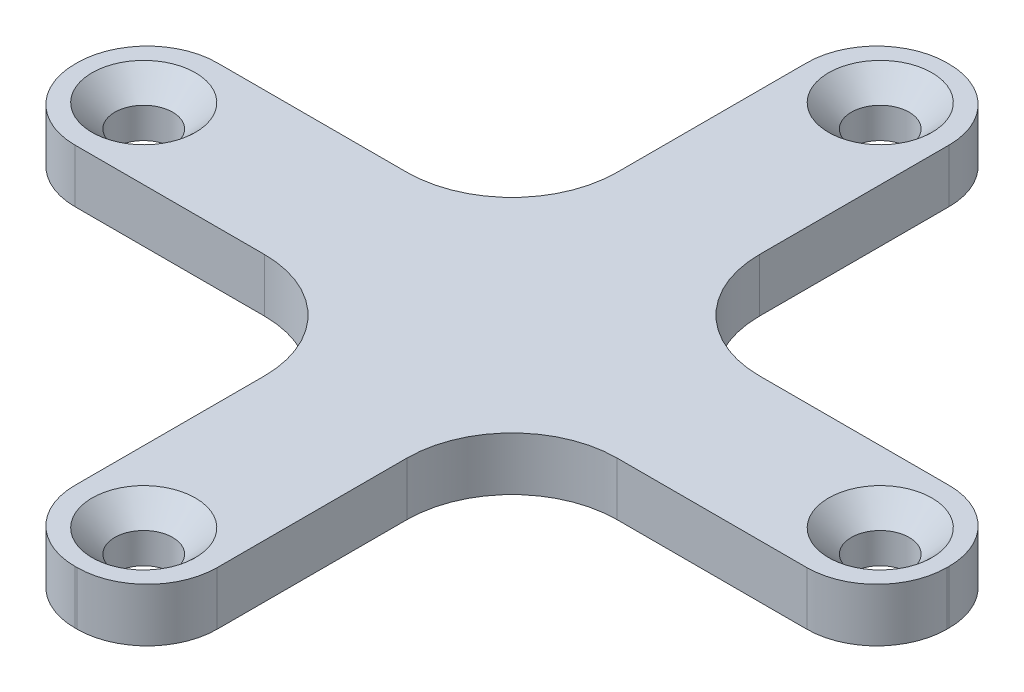
ISO-10303-21;
HEADER;
FILE_DESCRIPTION(('STEP AP214'),'2;1');
FILE_NAME('part.step','',(''),(''),'','','');
FILE_SCHEMA(('AUTOMOTIVE_DESIGN { 1 0 10303 214 1 1 1 1 }'));
ENDSEC;
DATA;
#1=APPLICATION_CONTEXT('core data for automotive mechanical design processes');
#2=APPLICATION_PROTOCOL_DEFINITION('international standard','automotive_design',2000,#1);
#3=PRODUCT_CONTEXT('',#1,'mechanical');
#4=PRODUCT('Part','Part','',(#3));
#5=PRODUCT_RELATED_PRODUCT_CATEGORY('part','',(#4));
#6=PRODUCT_DEFINITION_FORMATION('','',#4);
#7=PRODUCT_DEFINITION_CONTEXT('part definition',#1,'design');
#8=PRODUCT_DEFINITION('design','',#6,#7);
#9=PRODUCT_DEFINITION_SHAPE('','',#8);
#10=(LENGTH_UNIT() NAMED_UNIT(*) SI_UNIT(.MILLI.,.METRE.));
#11=(NAMED_UNIT(*) PLANE_ANGLE_UNIT() SI_UNIT($,.RADIAN.));
#12=(NAMED_UNIT(*) SI_UNIT($,.STERADIAN.) SOLID_ANGLE_UNIT());
#13=UNCERTAINTY_MEASURE_WITH_UNIT(LENGTH_MEASURE(1.E-05),#10,'distance_accuracy_value','');
#14=(GEOMETRIC_REPRESENTATION_CONTEXT(3) GLOBAL_UNCERTAINTY_ASSIGNED_CONTEXT((#13)) GLOBAL_UNIT_ASSIGNED_CONTEXT((#10,
#11,#12)) REPRESENTATION_CONTEXT('',''));
#15=CARTESIAN_POINT('',(0.,0.,0.));
#16=DIRECTION('',(0.,0.,1.));
#17=DIRECTION('',(1.,0.,0.));
#18=AXIS2_PLACEMENT_3D('',#15,#16,#17);
#19=CARTESIAN_POINT('',(24.895,3.048,4.06399999999997));
#20=DIRECTION('',(0.,-1.,0.));
#21=DIRECTION('',(0.,0.,-1.));
#22=AXIS2_PLACEMENT_3D('',#19,#20,#21);
#23=PLANE('',#22);
#24=CARTESIAN_POINT('',(0.,3.048,21.025));
#25=DIRECTION('',(0.,-1.,0.));
#26=DIRECTION('',(0.,0.,-1.));
#27=AXIS2_PLACEMENT_3D('',#24,#25,#26);
#28=CIRCLE('',#27,2.95100000000004);
#29=CARTESIAN_POINT('',(0.,3.048,18.074));
#30=VERTEX_POINT('',#29);
#31=EDGE_CURVE('E328',#30,#30,#28,.T.);
#32=ORIENTED_EDGE('',*,*,#31,.T.);
#33=EDGE_LOOP('',(#32));
#34=FACE_BOUND('',#33,.T.);
#35=CARTESIAN_POINT('',(-21.025,3.048,0.));
#36=DIRECTION('',(0.,-1.,0.));
#37=DIRECTION('',(0.,0.,-1.));
#38=AXIS2_PLACEMENT_3D('',#35,#36,#37);
#39=CIRCLE('',#38,2.95100000000004);
#40=CARTESIAN_POINT('',(-21.025,3.048,-2.95100000000003));
#41=VERTEX_POINT('',#40);
#42=EDGE_CURVE('E325',#41,#41,#39,.T.);
#43=ORIENTED_EDGE('',*,*,#42,.T.);
#44=EDGE_LOOP('',(#43));
#45=FACE_BOUND('',#44,.T.);
#46=CARTESIAN_POINT('',(0.,3.048,-21.025));
#47=DIRECTION('',(0.,-1.,0.));
#48=DIRECTION('',(0.,0.,-1.));
#49=AXIS2_PLACEMENT_3D('',#46,#47,#48);
#50=CIRCLE('',#49,2.95100000000004);
#51=CARTESIAN_POINT('',(0.,3.048,-23.976));
#52=VERTEX_POINT('',#51);
#53=EDGE_CURVE('E322',#52,#52,#50,.T.);
#54=ORIENTED_EDGE('',*,*,#53,.T.);
#55=EDGE_LOOP('',(#54));
#56=FACE_BOUND('',#55,.T.);
#57=CARTESIAN_POINT('',(21.025,3.048,0.));
#58=DIRECTION('',(0.,-1.,0.));
#59=DIRECTION('',(0.,0.,-1.));
#60=AXIS2_PLACEMENT_3D('',#57,#58,#59);
#61=CIRCLE('',#60,2.95100000000004);
#62=CARTESIAN_POINT('',(21.025,3.048,-2.95100000000004));
#63=VERTEX_POINT('',#62);
#64=EDGE_CURVE('E319',#63,#63,#61,.T.);
#65=ORIENTED_EDGE('',*,*,#64,.T.);
#66=EDGE_LOOP('',(#65));
#67=FACE_BOUND('',#66,.T.);
#68=DIRECTION('',(-1.,0.,0.));
#69=VECTOR('',#68,1.);
#70=CARTESIAN_POINT('',(4.06399999999998,3.048,-24.895));
#71=LINE('',#70,#69);
#72=CARTESIAN_POINT('',(0.0639999999999885,3.048,-24.895));
#73=VERTEX_POINT('',#72);
#74=CARTESIAN_POINT('',(-0.0640000000000059,3.048,-24.895));
#75=VERTEX_POINT('',#74);
#76=EDGE_CURVE('E450',#73,#75,#71,.T.);
#77=ORIENTED_EDGE('',*,*,#76,.T.);
#78=CARTESIAN_POINT('',(-0.0640000000000057,3.048,-20.895));
#79=DIRECTION('',(0.,-1.,0.));
#80=DIRECTION('',(0.,0.,-1.));
#81=AXIS2_PLACEMENT_3D('',#78,#79,#80);
#82=CIRCLE('',#81,4.);
#83=CARTESIAN_POINT('',(-4.06400000000001,3.048,-20.895));
#84=VERTEX_POINT('',#83);
#85=EDGE_CURVE('E278',#75,#84,#82,.F.);
#86=ORIENTED_EDGE('',*,*,#85,.T.);
#87=DIRECTION('',(0.,0.,1.));
#88=VECTOR('',#87,1.);
#89=CARTESIAN_POINT('',(-4.06400000000009,3.048,-4.064));
#90=LINE('',#89,#88);
#91=CARTESIAN_POINT('',(-4.06400000000006,3.048,-10.064));
#92=VERTEX_POINT('',#91);
#93=EDGE_CURVE('E214',#84,#92,#90,.T.);
#94=ORIENTED_EDGE('',*,*,#93,.T.);
#95=CARTESIAN_POINT('',(-10.0640000000001,3.048,-10.064));
#96=DIRECTION('',(0.,-1.,0.));
#97=DIRECTION('',(0.,0.,-1.));
#98=AXIS2_PLACEMENT_3D('',#95,#96,#97);
#99=CIRCLE('',#98,6.);
#100=CARTESIAN_POINT('',(-10.0640000000001,3.048,-4.06399999999999));
#101=VERTEX_POINT('',#100);
#102=EDGE_CURVE('E360',#92,#101,#99,.T.);
#103=ORIENTED_EDGE('',*,*,#102,.T.);
#104=DIRECTION('',(-1.,0.,0.));
#105=VECTOR('',#104,1.);
#106=CARTESIAN_POINT('',(-24.895,3.048,-4.06399999999998));
#107=LINE('',#106,#105);
#108=CARTESIAN_POINT('',(-20.895,3.048,-4.06399999999999));
#109=VERTEX_POINT('',#108);
#110=EDGE_CURVE('E428',#101,#109,#107,.T.);
#111=ORIENTED_EDGE('',*,*,#110,.T.);
#112=CARTESIAN_POINT('',(-20.895,3.048,-0.0639999999999885));
#113=DIRECTION('',(0.,-1.,0.));
#114=DIRECTION('',(0.,0.,-1.));
#115=AXIS2_PLACEMENT_3D('',#112,#113,#114);
#116=CIRCLE('',#115,4.);
#117=CARTESIAN_POINT('',(-24.895,3.048,-0.063999999999992));
#118=VERTEX_POINT('',#117);
#119=EDGE_CURVE('E264',#109,#118,#116,.F.);
#120=ORIENTED_EDGE('',*,*,#119,.T.);
#121=DIRECTION('',(0.,0.,1.));
#122=VECTOR('',#121,1.);
#123=CARTESIAN_POINT('',(-24.895,3.048,-4.06399999999998));
#124=LINE('',#123,#122);
#125=CARTESIAN_POINT('',(-24.895,3.048,0.0640000000000016));
#126=VERTEX_POINT('',#125);
#127=EDGE_CURVE('E425',#118,#126,#124,.T.);
#128=ORIENTED_EDGE('',*,*,#127,.T.);
#129=CARTESIAN_POINT('',(-20.895,3.048,0.0640000000000047));
#130=DIRECTION('',(0.,-1.,0.));
#131=DIRECTION('',(0.,0.,-1.));
#132=AXIS2_PLACEMENT_3D('',#129,#130,#131);
#133=CIRCLE('',#132,4.);
#134=CARTESIAN_POINT('',(-20.895,3.048,4.064));
#135=VERTEX_POINT('',#134);
#136=EDGE_CURVE('E266',#126,#135,#133,.F.);
#137=ORIENTED_EDGE('',*,*,#136,.T.);
#138=DIRECTION('',(1.,0.,0.));
#139=VECTOR('',#138,1.);
#140=CARTESIAN_POINT('',(-24.895,3.048,4.06400000000001));
#141=LINE('',#140,#139);
#142=CARTESIAN_POINT('',(-10.0640000000001,3.048,4.064));
#143=VERTEX_POINT('',#142);
#144=EDGE_CURVE('E421',#135,#143,#141,.T.);
#145=ORIENTED_EDGE('',*,*,#144,.T.);
#146=CARTESIAN_POINT('',(-10.0640000000001,3.048,10.064));
#147=DIRECTION('',(0.,-1.,0.));
#148=DIRECTION('',(0.,0.,-1.));
#149=AXIS2_PLACEMENT_3D('',#146,#147,#148);
#150=CIRCLE('',#149,6.);
#151=CARTESIAN_POINT('',(-4.06400000000007,3.048,10.064));
#152=VERTEX_POINT('',#151);
#153=EDGE_CURVE('E364',#143,#152,#150,.T.);
#154=ORIENTED_EDGE('',*,*,#153,.T.);
#155=DIRECTION('',(0.,0.,1.));
#156=VECTOR('',#155,1.);
#157=CARTESIAN_POINT('',(-4.064,3.048,24.895));
#158=LINE('',#157,#156);
#159=CARTESIAN_POINT('',(-4.06400000000002,3.048,20.895));
#160=VERTEX_POINT('',#159);
#161=EDGE_CURVE('E412',#152,#160,#158,.T.);
#162=ORIENTED_EDGE('',*,*,#161,.T.);
#163=CARTESIAN_POINT('',(-0.0640000000000189,3.048,20.895));
#164=DIRECTION('',(0.,-1.,0.));
#165=DIRECTION('',(0.,0.,-1.));
#166=AXIS2_PLACEMENT_3D('',#163,#164,#165);
#167=CIRCLE('',#166,4.);
#168=CARTESIAN_POINT('',(-0.0640000000000189,3.048,24.895));
#169=VERTEX_POINT('',#168);
#170=EDGE_CURVE('E268',#160,#169,#167,.F.);
#171=ORIENTED_EDGE('',*,*,#170,.T.);
#172=DIRECTION('',(1.,0.,0.));
#173=VECTOR('',#172,1.);
#174=CARTESIAN_POINT('',(4.064,3.048,24.895));
#175=LINE('',#174,#173);
#176=CARTESIAN_POINT('',(0.0639999999999842,3.048,24.895));
#177=VERTEX_POINT('',#176);
#178=EDGE_CURVE('E401',#169,#177,#175,.T.);
#179=ORIENTED_EDGE('',*,*,#178,.T.);
#180=CARTESIAN_POINT('',(0.0639999999999844,3.048,20.895));
#181=DIRECTION('',(0.,-1.,0.));
#182=DIRECTION('',(0.,0.,-1.));
#183=AXIS2_PLACEMENT_3D('',#180,#181,#182);
#184=CIRCLE('',#183,4.);
#185=CARTESIAN_POINT('',(4.06399999999998,3.048,20.895));
#186=VERTEX_POINT('',#185);
#187=EDGE_CURVE('E270',#177,#186,#184,.F.);
#188=ORIENTED_EDGE('',*,*,#187,.T.);
#189=DIRECTION('',(0.,0.,-1.));
#190=VECTOR('',#189,1.);
#191=CARTESIAN_POINT('',(4.06399999999991,3.048,4.064));
#192=LINE('',#191,#190);
#193=CARTESIAN_POINT('',(4.06399999999994,3.048,10.064));
#194=VERTEX_POINT('',#193);
#195=EDGE_CURVE('E216',#186,#194,#192,.T.);
#196=ORIENTED_EDGE('',*,*,#195,.T.);
#197=CARTESIAN_POINT('',(10.0639999999999,3.048,10.064));
#198=DIRECTION('',(0.,-1.,0.));
#199=DIRECTION('',(0.,0.,-1.));
#200=AXIS2_PLACEMENT_3D('',#197,#198,#199);
#201=CIRCLE('',#200,6.);
#202=CARTESIAN_POINT('',(10.0639999999999,3.048,4.06399999999999));
#203=VERTEX_POINT('',#202);
#204=EDGE_CURVE('E368',#194,#203,#201,.T.);
#205=ORIENTED_EDGE('',*,*,#204,.T.);
#206=DIRECTION('',(1.,0.,0.));
#207=VECTOR('',#206,1.);
#208=CARTESIAN_POINT('',(4.06399999999991,3.048,4.064));
#209=LINE('',#208,#207);
#210=CARTESIAN_POINT('',(20.895,3.048,4.06399999999998));
#211=VERTEX_POINT('',#210);
#212=EDGE_CURVE('E243',#203,#211,#209,.T.);
#213=ORIENTED_EDGE('',*,*,#212,.T.);
#214=CARTESIAN_POINT('',(20.895,3.048,0.0639999999999764));
#215=DIRECTION('',(0.,-1.,0.));
#216=DIRECTION('',(0.,0.,-1.));
#217=AXIS2_PLACEMENT_3D('',#214,#215,#216);
#218=CIRCLE('',#217,4.);
#219=CARTESIAN_POINT('',(24.895,3.048,0.0639999999999799));
#220=VERTEX_POINT('',#219);
#221=EDGE_CURVE('E272',#211,#220,#218,.F.);
#222=ORIENTED_EDGE('',*,*,#221,.T.);
#223=DIRECTION('',(0.,0.,-1.));
#224=VECTOR('',#223,1.);
#225=CARTESIAN_POINT('',(24.895,3.048,-4.06399999999999));
#226=LINE('',#225,#224);
#227=CARTESIAN_POINT('',(24.895,3.048,-0.0639999999999894));
#228=VERTEX_POINT('',#227);
#229=EDGE_CURVE('E383',#220,#228,#226,.T.);
#230=ORIENTED_EDGE('',*,*,#229,.T.);
#231=CARTESIAN_POINT('',(20.895,3.048,-0.063999999999993));
#232=DIRECTION('',(0.,-1.,0.));
#233=DIRECTION('',(0.,0.,-1.));
#234=AXIS2_PLACEMENT_3D('',#231,#232,#233);
#235=CIRCLE('',#234,4.);
#236=CARTESIAN_POINT('',(20.895,3.048,-4.06399999999999));
#237=VERTEX_POINT('',#236);
#238=EDGE_CURVE('E274',#228,#237,#235,.F.);
#239=ORIENTED_EDGE('',*,*,#238,.T.);
#240=DIRECTION('',(-1.,0.,0.));
#241=VECTOR('',#240,1.);
#242=CARTESIAN_POINT('',(4.064,3.048,-4.064));
#243=LINE('',#242,#241);
#244=CARTESIAN_POINT('',(10.064,3.048,-4.064));
#245=VERTEX_POINT('',#244);
#246=EDGE_CURVE('E456',#237,#245,#243,.T.);
#247=ORIENTED_EDGE('',*,*,#246,.T.);
#248=CARTESIAN_POINT('',(10.064,3.048,-10.064));
#249=DIRECTION('',(0.,-1.,0.));
#250=DIRECTION('',(0.,0.,-1.));
#251=AXIS2_PLACEMENT_3D('',#248,#249,#250);
#252=CIRCLE('',#251,6.);
#253=CARTESIAN_POINT('',(4.064,3.048,-10.064));
#254=VERTEX_POINT('',#253);
#255=EDGE_CURVE('E11',#245,#254,#252,.T.);
#256=ORIENTED_EDGE('',*,*,#255,.T.);
#257=DIRECTION('',(0.,0.,-1.));
#258=VECTOR('',#257,1.);
#259=CARTESIAN_POINT('',(4.064,3.048,-4.064));
#260=LINE('',#259,#258);
#261=CARTESIAN_POINT('',(4.06399999999999,3.048,-20.895));
#262=VERTEX_POINT('',#261);
#263=EDGE_CURVE('E451',#254,#262,#260,.T.);
#264=ORIENTED_EDGE('',*,*,#263,.T.);
#265=CARTESIAN_POINT('',(0.0639999999999885,3.048,-20.895));
#266=DIRECTION('',(0.,-1.,0.));
#267=DIRECTION('',(0.,0.,-1.));
#268=AXIS2_PLACEMENT_3D('',#265,#266,#267);
#269=CIRCLE('',#268,4.);
#270=EDGE_CURVE('E276',#262,#73,#269,.F.);
#271=ORIENTED_EDGE('',*,*,#270,.T.);
#272=EDGE_LOOP('',(#77,#86,#94,#103,#111,#120,#128,#137,#145,#154,#162,#171,#179,#188,#196,#205,
#213,#222,#230,#239,#247,#256,#264,#271));
#273=FACE_BOUND('',#272,.T.);
#274=ADVANCED_FACE('F34',(#34,#45,#56,#67,#273),#23,.F.);
#275=CARTESIAN_POINT('',(24.895,0.,4.06399999999997));
#276=DIRECTION('',(0.,-1.,0.));
#277=DIRECTION('',(0.,0.,-1.));
#278=AXIS2_PLACEMENT_3D('',#275,#276,#277);
#279=PLANE('',#278);
#280=CARTESIAN_POINT('',(-21.025,0.,0.));
#281=DIRECTION('',(0.,1.,0.));
#282=DIRECTION('',(0.,0.,-1.));
#283=AXIS2_PLACEMENT_3D('',#280,#281,#282);
#284=CIRCLE('',#283,1.651);
#285=CARTESIAN_POINT('',(-21.025,0.,-1.65099999999999));
#286=VERTEX_POINT('',#285);
#287=EDGE_CURVE('E743',#286,#286,#284,.T.);
#288=ORIENTED_EDGE('',*,*,#287,.T.);
#289=EDGE_LOOP('',(#288));
#290=FACE_BOUND('',#289,.T.);
#291=CARTESIAN_POINT('',(21.025,0.,0.));
#292=DIRECTION('',(0.,1.,0.));
#293=DIRECTION('',(0.,0.,1.));
#294=AXIS2_PLACEMENT_3D('',#291,#292,#293);
#295=CIRCLE('',#294,1.651);
#296=CARTESIAN_POINT('',(21.025,0.,1.651));
#297=VERTEX_POINT('',#296);
#298=EDGE_CURVE('E436',#297,#297,#295,.T.);
#299=ORIENTED_EDGE('',*,*,#298,.T.);
#300=EDGE_LOOP('',(#299));
#301=FACE_BOUND('',#300,.T.);
#302=DIRECTION('',(0.,0.,1.));
#303=VECTOR('',#302,1.);
#304=CARTESIAN_POINT('',(-4.06400000000009,0.,-4.064));
#305=LINE('',#304,#303);
#306=CARTESIAN_POINT('',(-4.06400000000001,0.,-20.895));
#307=VERTEX_POINT('',#306);
#308=CARTESIAN_POINT('',(-4.06400000000006,0.,-10.064));
#309=VERTEX_POINT('',#308);
#310=EDGE_CURVE('E211',#307,#309,#305,.T.);
#311=ORIENTED_EDGE('',*,*,#310,.F.);
#312=CARTESIAN_POINT('',(-0.0640000000000057,0.,-20.895));
#313=DIRECTION('',(0.,-1.,0.));
#314=DIRECTION('',(0.,0.,-1.));
#315=AXIS2_PLACEMENT_3D('',#312,#313,#314);
#316=CIRCLE('',#315,4.);
#317=CARTESIAN_POINT('',(-0.0640000000000059,0.,-24.895));
#318=VERTEX_POINT('',#317);
#319=EDGE_CURVE('E195',#307,#318,#316,.T.);
#320=ORIENTED_EDGE('',*,*,#319,.T.);
#321=DIRECTION('',(-1.,0.,0.));
#322=VECTOR('',#321,1.);
#323=CARTESIAN_POINT('',(4.06399999999998,0.,-24.895));
#324=LINE('',#323,#322);
#325=CARTESIAN_POINT('',(0.0639999999999885,0.,-24.895));
#326=VERTEX_POINT('',#325);
#327=EDGE_CURVE('E223',#326,#318,#324,.T.);
#328=ORIENTED_EDGE('',*,*,#327,.F.);
#329=CARTESIAN_POINT('',(0.0639999999999885,0.,-20.895));
#330=DIRECTION('',(0.,-1.,0.));
#331=DIRECTION('',(0.,0.,-1.));
#332=AXIS2_PLACEMENT_3D('',#329,#330,#331);
#333=CIRCLE('',#332,4.);
#334=CARTESIAN_POINT('',(4.06399999999999,0.,-20.895));
#335=VERTEX_POINT('',#334);
#336=EDGE_CURVE('E205',#326,#335,#333,.T.);
#337=ORIENTED_EDGE('',*,*,#336,.T.);
#338=DIRECTION('',(0.,0.,-1.));
#339=VECTOR('',#338,1.);
#340=CARTESIAN_POINT('',(4.064,0.,-4.064));
#341=LINE('',#340,#339);
#342=CARTESIAN_POINT('',(4.064,0.,-10.064));
#343=VERTEX_POINT('',#342);
#344=EDGE_CURVE('E227',#343,#335,#341,.T.);
#345=ORIENTED_EDGE('',*,*,#344,.F.);
#346=CARTESIAN_POINT('',(10.064,0.,-10.064));
#347=DIRECTION('',(0.,-1.,0.));
#348=DIRECTION('',(0.,0.,-1.));
#349=AXIS2_PLACEMENT_3D('',#346,#347,#348);
#350=CIRCLE('',#349,6.);
#351=CARTESIAN_POINT('',(10.064,0.,-4.064));
#352=VERTEX_POINT('',#351);
#353=EDGE_CURVE('E42',#343,#352,#350,.F.);
#354=ORIENTED_EDGE('',*,*,#353,.T.);
#355=DIRECTION('',(-1.,0.,0.));
#356=VECTOR('',#355,1.);
#357=CARTESIAN_POINT('',(4.064,0.,-4.064));
#358=LINE('',#357,#356);
#359=CARTESIAN_POINT('',(20.895,0.,-4.06399999999999));
#360=VERTEX_POINT('',#359);
#361=EDGE_CURVE('E439',#360,#352,#358,.T.);
#362=ORIENTED_EDGE('',*,*,#361,.F.);
#363=CARTESIAN_POINT('',(20.895,0.,-0.063999999999993));
#364=DIRECTION('',(0.,-1.,0.));
#365=DIRECTION('',(0.,0.,-1.));
#366=AXIS2_PLACEMENT_3D('',#363,#364,#365);
#367=CIRCLE('',#366,4.);
#368=CARTESIAN_POINT('',(24.895,0.,-0.0639999999999894));
#369=VERTEX_POINT('',#368);
#370=EDGE_CURVE('E257',#360,#369,#367,.T.);
#371=ORIENTED_EDGE('',*,*,#370,.T.);
#372=DIRECTION('',(0.,0.,-1.));
#373=VECTOR('',#372,1.);
#374=CARTESIAN_POINT('',(24.895,0.,-4.06399999999999));
#375=LINE('',#374,#373);
#376=CARTESIAN_POINT('',(24.895,0.,0.0639999999999799));
#377=VERTEX_POINT('',#376);
#378=EDGE_CURVE('E435',#377,#369,#375,.T.);
#379=ORIENTED_EDGE('',*,*,#378,.F.);
#380=CARTESIAN_POINT('',(20.895,0.,0.0639999999999764));
#381=DIRECTION('',(0.,-1.,0.));
#382=DIRECTION('',(0.,0.,-1.));
#383=AXIS2_PLACEMENT_3D('',#380,#381,#382);
#384=CIRCLE('',#383,4.);
#385=CARTESIAN_POINT('',(20.895,0.,4.06399999999998));
#386=VERTEX_POINT('',#385);
#387=EDGE_CURVE('E254',#377,#386,#384,.T.);
#388=ORIENTED_EDGE('',*,*,#387,.T.);
#389=DIRECTION('',(1.,0.,0.));
#390=VECTOR('',#389,1.);
#391=CARTESIAN_POINT('',(4.06399999999991,0.,4.064));
#392=LINE('',#391,#390);
#393=CARTESIAN_POINT('',(10.0639999999999,0.,4.06399999999999));
#394=VERTEX_POINT('',#393);
#395=EDGE_CURVE('E387',#394,#386,#392,.T.);
#396=ORIENTED_EDGE('',*,*,#395,.F.);
#397=CARTESIAN_POINT('',(10.0639999999999,0.,10.064));
#398=DIRECTION('',(0.,-1.,0.));
#399=DIRECTION('',(0.,0.,-1.));
#400=AXIS2_PLACEMENT_3D('',#397,#398,#399);
#401=CIRCLE('',#400,6.);
#402=CARTESIAN_POINT('',(4.06399999999994,0.,10.064));
#403=VERTEX_POINT('',#402);
#404=EDGE_CURVE('E366',#394,#403,#401,.F.);
#405=ORIENTED_EDGE('',*,*,#404,.T.);
#406=DIRECTION('',(0.,0.,-1.));
#407=VECTOR('',#406,1.);
#408=CARTESIAN_POINT('',(4.06399999999991,0.,4.064));
#409=LINE('',#408,#407);
#410=CARTESIAN_POINT('',(4.06399999999998,0.,20.895));
#411=VERTEX_POINT('',#410);
#412=EDGE_CURVE('E241',#411,#403,#409,.T.);
#413=ORIENTED_EDGE('',*,*,#412,.F.);
#414=CARTESIAN_POINT('',(0.0639999999999844,0.,20.895));
#415=DIRECTION('',(0.,-1.,0.));
#416=DIRECTION('',(0.,0.,-1.));
#417=AXIS2_PLACEMENT_3D('',#414,#415,#416);
#418=CIRCLE('',#417,4.);
#419=CARTESIAN_POINT('',(0.0639999999999842,0.,24.895));
#420=VERTEX_POINT('',#419);
#421=EDGE_CURVE('E252',#411,#420,#418,.T.);
#422=ORIENTED_EDGE('',*,*,#421,.T.);
#423=DIRECTION('',(1.,0.,0.));
#424=VECTOR('',#423,1.);
#425=CARTESIAN_POINT('',(4.064,0.,24.895));
#426=LINE('',#425,#424);
#427=CARTESIAN_POINT('',(-0.0640000000000189,0.,24.895));
#428=VERTEX_POINT('',#427);
#429=EDGE_CURVE('E238',#428,#420,#426,.T.);
#430=ORIENTED_EDGE('',*,*,#429,.F.);
#431=CARTESIAN_POINT('',(-0.0640000000000189,0.,20.895));
#432=DIRECTION('',(0.,-1.,0.));
#433=DIRECTION('',(0.,0.,-1.));
#434=AXIS2_PLACEMENT_3D('',#431,#432,#433);
#435=CIRCLE('',#434,4.);
#436=CARTESIAN_POINT('',(-4.06400000000002,0.,20.895));
#437=VERTEX_POINT('',#436);
#438=EDGE_CURVE('E249',#428,#437,#435,.T.);
#439=ORIENTED_EDGE('',*,*,#438,.T.);
#440=DIRECTION('',(0.,0.,1.));
#441=VECTOR('',#440,1.);
#442=CARTESIAN_POINT('',(-4.064,0.,24.895));
#443=LINE('',#442,#441);
#444=CARTESIAN_POINT('',(-4.06400000000007,0.,10.064));
#445=VERTEX_POINT('',#444);
#446=EDGE_CURVE('E236',#445,#437,#443,.T.);
#447=ORIENTED_EDGE('',*,*,#446,.F.);
#448=CARTESIAN_POINT('',(-10.0640000000001,0.,10.064));
#449=DIRECTION('',(0.,-1.,0.));
#450=DIRECTION('',(0.,0.,-1.));
#451=AXIS2_PLACEMENT_3D('',#448,#449,#450);
#452=CIRCLE('',#451,6.);
#453=CARTESIAN_POINT('',(-10.0640000000001,0.,4.064));
#454=VERTEX_POINT('',#453);
#455=EDGE_CURVE('E362',#445,#454,#452,.F.);
#456=ORIENTED_EDGE('',*,*,#455,.T.);
#457=DIRECTION('',(1.,0.,0.));
#458=VECTOR('',#457,1.);
#459=CARTESIAN_POINT('',(-24.895,0.,4.06400000000001));
#460=LINE('',#459,#458);
#461=CARTESIAN_POINT('',(-20.895,0.,4.064));
#462=VERTEX_POINT('',#461);
#463=EDGE_CURVE('E233',#462,#454,#460,.T.);
#464=ORIENTED_EDGE('',*,*,#463,.F.);
#465=CARTESIAN_POINT('',(-20.895,0.,0.0640000000000047));
#466=DIRECTION('',(0.,-1.,0.));
#467=DIRECTION('',(0.,0.,-1.));
#468=AXIS2_PLACEMENT_3D('',#465,#466,#467);
#469=CIRCLE('',#468,4.);
#470=CARTESIAN_POINT('',(-24.895,0.,0.0640000000000016));
#471=VERTEX_POINT('',#470);
#472=EDGE_CURVE('E247',#462,#471,#469,.T.);
#473=ORIENTED_EDGE('',*,*,#472,.T.);
#474=DIRECTION('',(0.,0.,1.));
#475=VECTOR('',#474,1.);
#476=CARTESIAN_POINT('',(-24.895,0.,-4.06399999999998));
#477=LINE('',#476,#475);
#478=CARTESIAN_POINT('',(-24.895,0.,-0.063999999999992));
#479=VERTEX_POINT('',#478);
#480=EDGE_CURVE('E225',#479,#471,#477,.T.);
#481=ORIENTED_EDGE('',*,*,#480,.F.);
#482=CARTESIAN_POINT('',(-20.895,0.,-0.0639999999999885));
#483=DIRECTION('',(0.,-1.,0.));
#484=DIRECTION('',(0.,0.,-1.));
#485=AXIS2_PLACEMENT_3D('',#482,#483,#484);
#486=CIRCLE('',#485,4.);
#487=CARTESIAN_POINT('',(-20.895,0.,-4.06399999999999));
#488=VERTEX_POINT('',#487);
#489=EDGE_CURVE('E215',#479,#488,#486,.T.);
#490=ORIENTED_EDGE('',*,*,#489,.T.);
#491=DIRECTION('',(-1.,0.,0.));
#492=VECTOR('',#491,1.);
#493=CARTESIAN_POINT('',(-24.895,0.,-4.06399999999998));
#494=LINE('',#493,#492);
#495=CARTESIAN_POINT('',(-10.0640000000001,0.,-4.06399999999999));
#496=VERTEX_POINT('',#495);
#497=EDGE_CURVE('E222',#496,#488,#494,.T.);
#498=ORIENTED_EDGE('',*,*,#497,.F.);
#499=CARTESIAN_POINT('',(-10.0640000000001,0.,-10.064));
#500=DIRECTION('',(0.,-1.,0.));
#501=DIRECTION('',(0.,0.,-1.));
#502=AXIS2_PLACEMENT_3D('',#499,#500,#501);
#503=CIRCLE('',#502,6.);
#504=EDGE_CURVE('E221',#496,#309,#503,.F.);
#505=ORIENTED_EDGE('',*,*,#504,.T.);
#506=EDGE_LOOP('',(#311,#320,#328,#337,#345,#354,#362,#371,#379,#388,#396,#405,#413,#422,#430,
#439,#447,#456,#464,#473,#481,#490,#498,#505));
#507=FACE_BOUND('',#506,.T.);
#508=CARTESIAN_POINT('',(0.,0.,-21.025));
#509=DIRECTION('',(0.,1.,0.));
#510=DIRECTION('',(0.,0.,-1.));
#511=AXIS2_PLACEMENT_3D('',#508,#509,#510);
#512=CIRCLE('',#511,1.651);
#513=CARTESIAN_POINT('',(0.,0.,-22.676));
#514=VERTEX_POINT('',#513);
#515=EDGE_CURVE('E740',#514,#514,#512,.T.);
#516=ORIENTED_EDGE('',*,*,#515,.T.);
#517=EDGE_LOOP('',(#516));
#518=FACE_BOUND('',#517,.T.);
#519=CARTESIAN_POINT('',(0.,0.,21.025));
#520=DIRECTION('',(0.,1.,0.));
#521=DIRECTION('',(0.,0.,1.));
#522=AXIS2_PLACEMENT_3D('',#519,#520,#521);
#523=CIRCLE('',#522,1.651);
#524=CARTESIAN_POINT('',(0.,0.,22.676));
#525=VERTEX_POINT('',#524);
#526=EDGE_CURVE('E746',#525,#525,#523,.T.);
#527=ORIENTED_EDGE('',*,*,#526,.T.);
#528=EDGE_LOOP('',(#527));
#529=FACE_BOUND('',#528,.T.);
#530=ADVANCED_FACE('F218',(#290,#301,#507,#518,#529),#279,.T.);
#531=CARTESIAN_POINT('',(4.06399999999991,3.048,4.064));
#532=DIRECTION('',(0.,0.,-1.));
#533=DIRECTION('',(-1.,0.,0.));
#534=AXIS2_PLACEMENT_3D('',#531,#532,#533);
#535=PLANE('',#534);
#536=ORIENTED_EDGE('',*,*,#212,.F.);
#537=DIRECTION('',(0.,-1.,0.));
#538=VECTOR('',#537,1.);
#539=CARTESIAN_POINT('',(10.0639999999999,0.,4.06399999999999));
#540=LINE('',#539,#538);
#541=EDGE_CURVE('E350',#203,#394,#540,.T.);
#542=ORIENTED_EDGE('',*,*,#541,.T.);
#543=ORIENTED_EDGE('',*,*,#395,.T.);
#544=DIRECTION('',(0.,-1.,0.));
#545=VECTOR('',#544,1.);
#546=CARTESIAN_POINT('',(20.895,3.048,4.06399999999998));
#547=LINE('',#546,#545);
#548=EDGE_CURVE('E291',#386,#211,#547,.F.);
#549=ORIENTED_EDGE('',*,*,#548,.T.);
#550=EDGE_LOOP('',(#536,#542,#543,#549));
#551=FACE_BOUND('',#550,.T.);
#552=ADVANCED_FACE('F379',(#551),#535,.F.);
#553=CARTESIAN_POINT('',(24.895,3.048,-4.06399999999999));
#554=DIRECTION('',(-1.,0.,0.));
#555=DIRECTION('',(0.,0.,1.));
#556=AXIS2_PLACEMENT_3D('',#553,#554,#555);
#557=PLANE('',#556);
#558=ORIENTED_EDGE('',*,*,#378,.T.);
#559=DIRECTION('',(0.,-1.,0.));
#560=VECTOR('',#559,1.);
#561=CARTESIAN_POINT('',(24.895,3.048,-0.0639999999999894));
#562=LINE('',#561,#560);
#563=EDGE_CURVE('E289',#369,#228,#562,.F.);
#564=ORIENTED_EDGE('',*,*,#563,.T.);
#565=ORIENTED_EDGE('',*,*,#229,.F.);
#566=DIRECTION('',(0.,-1.,0.));
#567=VECTOR('',#566,1.);
#568=CARTESIAN_POINT('',(24.895,3.048,0.0639999999999799));
#569=LINE('',#568,#567);
#570=EDGE_CURVE('E286',#220,#377,#569,.T.);
#571=ORIENTED_EDGE('',*,*,#570,.T.);
#572=EDGE_LOOP('',(#558,#564,#565,#571));
#573=FACE_BOUND('',#572,.T.);
#574=ADVANCED_FACE('F519',(#573),#557,.F.);
#575=CARTESIAN_POINT('',(4.064,3.048,-4.064));
#576=DIRECTION('',(0.,0.,1.));
#577=DIRECTION('',(1.,0.,0.));
#578=AXIS2_PLACEMENT_3D('',#575,#576,#577);
#579=PLANE('',#578);
#580=ORIENTED_EDGE('',*,*,#361,.T.);
#581=DIRECTION('',(0.,-1.,0.));
#582=VECTOR('',#581,1.);
#583=CARTESIAN_POINT('',(10.064,3.048,-4.064));
#584=LINE('',#583,#582);
#585=EDGE_CURVE('E55',#352,#245,#584,.F.);
#586=ORIENTED_EDGE('',*,*,#585,.T.);
#587=ORIENTED_EDGE('',*,*,#246,.F.);
#588=DIRECTION('',(0.,-1.,0.));
#589=VECTOR('',#588,1.);
#590=CARTESIAN_POINT('',(20.895,3.048,-4.06399999999999));
#591=LINE('',#590,#589);
#592=EDGE_CURVE('E283',#237,#360,#591,.T.);
#593=ORIENTED_EDGE('',*,*,#592,.T.);
#594=EDGE_LOOP('',(#580,#586,#587,#593));
#595=FACE_BOUND('',#594,.T.);
#596=ADVANCED_FACE('F516',(#595),#579,.F.);
#597=CARTESIAN_POINT('',(4.064,3.048,-4.064));
#598=DIRECTION('',(-1.,0.,0.));
#599=DIRECTION('',(0.,0.,1.));
#600=AXIS2_PLACEMENT_3D('',#597,#598,#599);
#601=PLANE('',#600);
#602=ORIENTED_EDGE('',*,*,#263,.F.);
#603=DIRECTION('',(0.,-1.,0.));
#604=VECTOR('',#603,1.);
#605=CARTESIAN_POINT('',(4.064,0.,-10.064));
#606=LINE('',#605,#604);
#607=EDGE_CURVE('E355',#254,#343,#606,.T.);
#608=ORIENTED_EDGE('',*,*,#607,.T.);
#609=ORIENTED_EDGE('',*,*,#344,.T.);
#610=DIRECTION('',(0.,-1.,0.));
#611=VECTOR('',#610,1.);
#612=CARTESIAN_POINT('',(4.06399999999999,3.048,-20.895));
#613=LINE('',#612,#611);
#614=EDGE_CURVE('E280',#335,#262,#613,.F.);
#615=ORIENTED_EDGE('',*,*,#614,.T.);
#616=EDGE_LOOP('',(#602,#608,#609,#615));
#617=FACE_BOUND('',#616,.T.);
#618=ADVANCED_FACE('F442',(#617),#601,.F.);
#619=CARTESIAN_POINT('',(4.06399999999998,3.048,-24.895));
#620=DIRECTION('',(0.,0.,1.));
#621=DIRECTION('',(1.,0.,0.));
#622=AXIS2_PLACEMENT_3D('',#619,#620,#621);
#623=PLANE('',#622);
#624=ORIENTED_EDGE('',*,*,#327,.T.);
#625=DIRECTION('',(0.,-1.,0.));
#626=VECTOR('',#625,1.);
#627=CARTESIAN_POINT('',(-0.0640000000000059,3.048,-24.895));
#628=LINE('',#627,#626);
#629=EDGE_CURVE('E200',#318,#75,#628,.F.);
#630=ORIENTED_EDGE('',*,*,#629,.T.);
#631=ORIENTED_EDGE('',*,*,#76,.F.);
#632=DIRECTION('',(0.,-1.,0.));
#633=VECTOR('',#632,1.);
#634=CARTESIAN_POINT('',(0.0639999999999885,3.048,-24.895));
#635=LINE('',#634,#633);
#636=EDGE_CURVE('E204',#73,#326,#635,.T.);
#637=ORIENTED_EDGE('',*,*,#636,.T.);
#638=EDGE_LOOP('',(#624,#630,#631,#637));
#639=FACE_BOUND('',#638,.T.);
#640=ADVANCED_FACE('F453',(#639),#623,.F.);
#641=CARTESIAN_POINT('',(-4.06400000000009,3.048,-4.064));
#642=DIRECTION('',(1.,0.,0.));
#643=DIRECTION('',(0.,0.,-1.));
#644=AXIS2_PLACEMENT_3D('',#641,#642,#643);
#645=PLANE('',#644);
#646=ORIENTED_EDGE('',*,*,#310,.T.);
#647=DIRECTION('',(0.,-1.,0.));
#648=VECTOR('',#647,1.);
#649=CARTESIAN_POINT('',(-4.06400000000006,3.048,-10.064));
#650=LINE('',#649,#648);
#651=EDGE_CURVE('E343',#309,#92,#650,.F.);
#652=ORIENTED_EDGE('',*,*,#651,.T.);
#653=ORIENTED_EDGE('',*,*,#93,.F.);
#654=DIRECTION('',(0.,-1.,0.));
#655=VECTOR('',#654,1.);
#656=CARTESIAN_POINT('',(-4.06400000000001,3.048,-20.895));
#657=LINE('',#656,#655);
#658=EDGE_CURVE('E199',#84,#307,#657,.T.);
#659=ORIENTED_EDGE('',*,*,#658,.T.);
#660=EDGE_LOOP('',(#646,#652,#653,#659));
#661=FACE_BOUND('',#660,.T.);
#662=ADVANCED_FACE('F210',(#661),#645,.F.);
#663=CARTESIAN_POINT('',(-24.895,3.048,-4.06399999999998));
#664=DIRECTION('',(0.,0.,1.));
#665=DIRECTION('',(1.,0.,0.));
#666=AXIS2_PLACEMENT_3D('',#663,#664,#665);
#667=PLANE('',#666);
#668=ORIENTED_EDGE('',*,*,#110,.F.);
#669=DIRECTION('',(0.,-1.,0.));
#670=VECTOR('',#669,1.);
#671=CARTESIAN_POINT('',(-10.0640000000001,0.,-4.06399999999999));
#672=LINE('',#671,#670);
#673=EDGE_CURVE('E340',#101,#496,#672,.T.);
#674=ORIENTED_EDGE('',*,*,#673,.T.);
#675=ORIENTED_EDGE('',*,*,#497,.T.);
#676=DIRECTION('',(0.,-1.,0.));
#677=VECTOR('',#676,1.);
#678=CARTESIAN_POINT('',(-20.895,3.048,-4.06399999999999));
#679=LINE('',#678,#677);
#680=EDGE_CURVE('E313',#488,#109,#679,.F.);
#681=ORIENTED_EDGE('',*,*,#680,.T.);
#682=EDGE_LOOP('',(#668,#674,#675,#681));
#683=FACE_BOUND('',#682,.T.);
#684=ADVANCED_FACE('F466',(#683),#667,.F.);
#685=CARTESIAN_POINT('',(-24.895,3.048,-4.06399999999998));
#686=DIRECTION('',(1.,0.,0.));
#687=DIRECTION('',(0.,0.,-1.));
#688=AXIS2_PLACEMENT_3D('',#685,#686,#687);
#689=PLANE('',#688);
#690=ORIENTED_EDGE('',*,*,#480,.T.);
#691=DIRECTION('',(0.,-1.,0.));
#692=VECTOR('',#691,1.);
#693=CARTESIAN_POINT('',(-24.895,3.048,0.0640000000000016));
#694=LINE('',#693,#692);
#695=EDGE_CURVE('E311',#471,#126,#694,.F.);
#696=ORIENTED_EDGE('',*,*,#695,.T.);
#697=ORIENTED_EDGE('',*,*,#127,.F.);
#698=DIRECTION('',(0.,-1.,0.));
#699=VECTOR('',#698,1.);
#700=CARTESIAN_POINT('',(-24.895,3.048,-0.063999999999992));
#701=LINE('',#700,#699);
#702=EDGE_CURVE('E308',#118,#479,#701,.T.);
#703=ORIENTED_EDGE('',*,*,#702,.T.);
#704=EDGE_LOOP('',(#690,#696,#697,#703));
#705=FACE_BOUND('',#704,.T.);
#706=ADVANCED_FACE('F472',(#705),#689,.F.);
#707=CARTESIAN_POINT('',(-24.895,3.048,4.06400000000001));
#708=DIRECTION('',(0.,0.,-1.));
#709=DIRECTION('',(-1.,0.,0.));
#710=AXIS2_PLACEMENT_3D('',#707,#708,#709);
#711=PLANE('',#710);
#712=ORIENTED_EDGE('',*,*,#463,.T.);
#713=DIRECTION('',(0.,-1.,0.));
#714=VECTOR('',#713,1.);
#715=CARTESIAN_POINT('',(-10.0640000000001,3.048,4.064));
#716=LINE('',#715,#714);
#717=EDGE_CURVE('E348',#454,#143,#716,.F.);
#718=ORIENTED_EDGE('',*,*,#717,.T.);
#719=ORIENTED_EDGE('',*,*,#144,.F.);
#720=DIRECTION('',(0.,-1.,0.));
#721=VECTOR('',#720,1.);
#722=CARTESIAN_POINT('',(-20.895,3.048,4.064));
#723=LINE('',#722,#721);
#724=EDGE_CURVE('E305',#135,#462,#723,.T.);
#725=ORIENTED_EDGE('',*,*,#724,.T.);
#726=EDGE_LOOP('',(#712,#718,#719,#725));
#727=FACE_BOUND('',#726,.T.);
#728=ADVANCED_FACE('F420',(#727),#711,.F.);
#729=CARTESIAN_POINT('',(-4.064,3.048,24.895));
#730=DIRECTION('',(1.,0.,0.));
#731=DIRECTION('',(0.,0.,-1.));
#732=AXIS2_PLACEMENT_3D('',#729,#730,#731);
#733=PLANE('',#732);
#734=ORIENTED_EDGE('',*,*,#161,.F.);
#735=DIRECTION('',(0.,-1.,0.));
#736=VECTOR('',#735,1.);
#737=CARTESIAN_POINT('',(-4.06400000000007,0.,10.064));
#738=LINE('',#737,#736);
#739=EDGE_CURVE('E345',#152,#445,#738,.T.);
#740=ORIENTED_EDGE('',*,*,#739,.T.);
#741=ORIENTED_EDGE('',*,*,#446,.T.);
#742=DIRECTION('',(0.,-1.,0.));
#743=VECTOR('',#742,1.);
#744=CARTESIAN_POINT('',(-4.06400000000002,3.048,20.895));
#745=LINE('',#744,#743);
#746=EDGE_CURVE('E302',#437,#160,#745,.F.);
#747=ORIENTED_EDGE('',*,*,#746,.T.);
#748=EDGE_LOOP('',(#734,#740,#741,#747));
#749=FACE_BOUND('',#748,.T.);
#750=ADVANCED_FACE('F410',(#749),#733,.F.);
#751=CARTESIAN_POINT('',(4.064,3.048,24.895));
#752=DIRECTION('',(0.,0.,-1.));
#753=DIRECTION('',(-1.,0.,0.));
#754=AXIS2_PLACEMENT_3D('',#751,#752,#753);
#755=PLANE('',#754);
#756=ORIENTED_EDGE('',*,*,#429,.T.);
#757=DIRECTION('',(0.,-1.,0.));
#758=VECTOR('',#757,1.);
#759=CARTESIAN_POINT('',(0.0639999999999842,3.048,24.895));
#760=LINE('',#759,#758);
#761=EDGE_CURVE('E300',#420,#177,#760,.F.);
#762=ORIENTED_EDGE('',*,*,#761,.T.);
#763=ORIENTED_EDGE('',*,*,#178,.F.);
#764=DIRECTION('',(0.,-1.,0.));
#765=VECTOR('',#764,1.);
#766=CARTESIAN_POINT('',(-0.0640000000000189,3.048,24.895));
#767=LINE('',#766,#765);
#768=EDGE_CURVE('E297',#169,#428,#767,.T.);
#769=ORIENTED_EDGE('',*,*,#768,.T.);
#770=EDGE_LOOP('',(#756,#762,#763,#769));
#771=FACE_BOUND('',#770,.T.);
#772=ADVANCED_FACE('F397',(#771),#755,.F.);
#773=CARTESIAN_POINT('',(4.06399999999991,3.048,4.064));
#774=DIRECTION('',(-1.,0.,0.));
#775=DIRECTION('',(0.,0.,1.));
#776=AXIS2_PLACEMENT_3D('',#773,#774,#775);
#777=PLANE('',#776);
#778=ORIENTED_EDGE('',*,*,#412,.T.);
#779=DIRECTION('',(0.,-1.,0.));
#780=VECTOR('',#779,1.);
#781=CARTESIAN_POINT('',(4.06399999999994,3.048,10.064));
#782=LINE('',#781,#780);
#783=EDGE_CURVE('E353',#403,#194,#782,.F.);
#784=ORIENTED_EDGE('',*,*,#783,.T.);
#785=ORIENTED_EDGE('',*,*,#195,.F.);
#786=DIRECTION('',(0.,-1.,0.));
#787=VECTOR('',#786,1.);
#788=CARTESIAN_POINT('',(4.06399999999998,3.048,20.895));
#789=LINE('',#788,#787);
#790=EDGE_CURVE('E294',#186,#411,#789,.T.);
#791=ORIENTED_EDGE('',*,*,#790,.T.);
#792=EDGE_LOOP('',(#778,#784,#785,#791));
#793=FACE_BOUND('',#792,.T.);
#794=ADVANCED_FACE('F389',(#793),#777,.F.);
#795=CARTESIAN_POINT('',(21.025,3.048,0.));
#796=DIRECTION('',(0.,-1.,0.));
#797=DIRECTION('',(0.,0.,-1.));
#798=AXIS2_PLACEMENT_3D('',#795,#796,#797);
#799=CYLINDRICAL_SURFACE('',#798,1.651);
#800=CARTESIAN_POINT('',(21.025,1.74799999999996,0.));
#801=DIRECTION('',(0.,-1.,0.));
#802=DIRECTION('',(0.,0.,-1.));
#803=AXIS2_PLACEMENT_3D('',#800,#801,#802);
#804=CIRCLE('',#803,1.651);
#805=CARTESIAN_POINT('',(21.025,1.74799999999996,-1.65099999999999));
#806=VERTEX_POINT('',#805);
#807=EDGE_CURVE('E337',#806,#806,#804,.F.);
#808=ORIENTED_EDGE('',*,*,#807,.T.);
#809=EDGE_LOOP('',(#808));
#810=FACE_BOUND('',#809,.T.);
#811=ORIENTED_EDGE('',*,*,#298,.F.);
#812=EDGE_LOOP('',(#811));
#813=FACE_BOUND('',#812,.T.);
#814=ADVANCED_FACE('F495',(#810,#813),#799,.F.);
#815=CARTESIAN_POINT('',(0.,3.048,-21.025));
#816=DIRECTION('',(0.,-1.,0.));
#817=DIRECTION('',(0.,0.,-1.));
#818=AXIS2_PLACEMENT_3D('',#815,#816,#817);
#819=CYLINDRICAL_SURFACE('',#818,1.651);
#820=CARTESIAN_POINT('',(0.,1.74799999999996,-21.025));
#821=DIRECTION('',(0.,-1.,0.));
#822=DIRECTION('',(0.,0.,-1.));
#823=AXIS2_PLACEMENT_3D('',#820,#821,#822);
#824=CIRCLE('',#823,1.651);
#825=CARTESIAN_POINT('',(0.,1.74799999999996,-22.676));
#826=VERTEX_POINT('',#825);
#827=EDGE_CURVE('E334',#826,#826,#824,.F.);
#828=ORIENTED_EDGE('',*,*,#827,.T.);
#829=EDGE_LOOP('',(#828));
#830=FACE_BOUND('',#829,.T.);
#831=ORIENTED_EDGE('',*,*,#515,.F.);
#832=EDGE_LOOP('',(#831));
#833=FACE_BOUND('',#832,.T.);
#834=ADVANCED_FACE('F568',(#830,#833),#819,.F.);
#835=CARTESIAN_POINT('',(-21.025,3.048,0.));
#836=DIRECTION('',(0.,-1.,0.));
#837=DIRECTION('',(0.,0.,-1.));
#838=AXIS2_PLACEMENT_3D('',#835,#836,#837);
#839=CYLINDRICAL_SURFACE('',#838,1.651);
#840=CARTESIAN_POINT('',(-21.025,1.74799999999996,0.));
#841=DIRECTION('',(0.,-1.,0.));
#842=DIRECTION('',(0.,0.,-1.));
#843=AXIS2_PLACEMENT_3D('',#840,#841,#842);
#844=CIRCLE('',#843,1.651);
#845=CARTESIAN_POINT('',(-21.025,1.74799999999996,-1.65099999999999));
#846=VERTEX_POINT('',#845);
#847=EDGE_CURVE('E331',#846,#846,#844,.F.);
#848=ORIENTED_EDGE('',*,*,#847,.T.);
#849=EDGE_LOOP('',(#848));
#850=FACE_BOUND('',#849,.T.);
#851=ORIENTED_EDGE('',*,*,#287,.F.);
#852=EDGE_LOOP('',(#851));
#853=FACE_BOUND('',#852,.T.);
#854=ADVANCED_FACE('F578',(#850,#853),#839,.F.);
#855=CARTESIAN_POINT('',(0.,3.048,21.025));
#856=DIRECTION('',(0.,-1.,0.));
#857=DIRECTION('',(0.,0.,-1.));
#858=AXIS2_PLACEMENT_3D('',#855,#856,#857);
#859=CYLINDRICAL_SURFACE('',#858,1.651);
#860=CARTESIAN_POINT('',(0.,1.74799999999996,21.025));
#861=DIRECTION('',(0.,-1.,0.));
#862=DIRECTION('',(0.,0.,-1.));
#863=AXIS2_PLACEMENT_3D('',#860,#861,#862);
#864=CIRCLE('',#863,1.651);
#865=CARTESIAN_POINT('',(0.,1.74799999999996,19.374));
#866=VERTEX_POINT('',#865);
#867=EDGE_CURVE('E316',#866,#866,#864,.F.);
#868=ORIENTED_EDGE('',*,*,#867,.T.);
#869=EDGE_LOOP('',(#868));
#870=FACE_BOUND('',#869,.T.);
#871=ORIENTED_EDGE('',*,*,#526,.F.);
#872=EDGE_LOOP('',(#871));
#873=FACE_BOUND('',#872,.T.);
#874=ADVANCED_FACE('F527',(#870,#873),#859,.F.);
#875=CARTESIAN_POINT('',(-0.0640000000000057,3.048,-20.895));
#876=DIRECTION('',(0.,-1.,0.));
#877=DIRECTION('',(0.,0.,-1.));
#878=AXIS2_PLACEMENT_3D('',#875,#876,#877);
#879=CYLINDRICAL_SURFACE('',#878,4.);
#880=ORIENTED_EDGE('',*,*,#85,.F.);
#881=ORIENTED_EDGE('',*,*,#629,.F.);
#882=ORIENTED_EDGE('',*,*,#319,.F.);
#883=ORIENTED_EDGE('',*,*,#658,.F.);
#884=EDGE_LOOP('',(#880,#881,#882,#883));
#885=FACE_BOUND('',#884,.T.);
#886=ADVANCED_FACE('F198',(#885),#879,.T.);
#887=CARTESIAN_POINT('',(0.0639999999999885,3.048,-20.895));
#888=DIRECTION('',(0.,-1.,0.));
#889=DIRECTION('',(0.,0.,-1.));
#890=AXIS2_PLACEMENT_3D('',#887,#888,#889);
#891=CYLINDRICAL_SURFACE('',#890,4.);
#892=ORIENTED_EDGE('',*,*,#270,.F.);
#893=ORIENTED_EDGE('',*,*,#614,.F.);
#894=ORIENTED_EDGE('',*,*,#336,.F.);
#895=ORIENTED_EDGE('',*,*,#636,.F.);
#896=EDGE_LOOP('',(#892,#893,#894,#895));
#897=FACE_BOUND('',#896,.T.);
#898=ADVANCED_FACE('F448',(#897),#891,.T.);
#899=CARTESIAN_POINT('',(20.895,3.048,-0.063999999999993));
#900=DIRECTION('',(0.,-1.,0.));
#901=DIRECTION('',(0.,0.,-1.));
#902=AXIS2_PLACEMENT_3D('',#899,#900,#901);
#903=CYLINDRICAL_SURFACE('',#902,4.);
#904=ORIENTED_EDGE('',*,*,#238,.F.);
#905=ORIENTED_EDGE('',*,*,#563,.F.);
#906=ORIENTED_EDGE('',*,*,#370,.F.);
#907=ORIENTED_EDGE('',*,*,#592,.F.);
#908=EDGE_LOOP('',(#904,#905,#906,#907));
#909=FACE_BOUND('',#908,.T.);
#910=ADVANCED_FACE('F530',(#909),#903,.T.);
#911=CARTESIAN_POINT('',(20.895,3.048,0.0639999999999764));
#912=DIRECTION('',(0.,-1.,0.));
#913=DIRECTION('',(0.,0.,-1.));
#914=AXIS2_PLACEMENT_3D('',#911,#912,#913);
#915=CYLINDRICAL_SURFACE('',#914,4.);
#916=ORIENTED_EDGE('',*,*,#221,.F.);
#917=ORIENTED_EDGE('',*,*,#548,.F.);
#918=ORIENTED_EDGE('',*,*,#387,.F.);
#919=ORIENTED_EDGE('',*,*,#570,.F.);
#920=EDGE_LOOP('',(#916,#917,#918,#919));
#921=FACE_BOUND('',#920,.T.);
#922=ADVANCED_FACE('F533',(#921),#915,.T.);
#923=CARTESIAN_POINT('',(0.0639999999999844,3.048,20.895));
#924=DIRECTION('',(0.,-1.,0.));
#925=DIRECTION('',(0.,0.,-1.));
#926=AXIS2_PLACEMENT_3D('',#923,#924,#925);
#927=CYLINDRICAL_SURFACE('',#926,4.);
#928=ORIENTED_EDGE('',*,*,#187,.F.);
#929=ORIENTED_EDGE('',*,*,#761,.F.);
#930=ORIENTED_EDGE('',*,*,#421,.F.);
#931=ORIENTED_EDGE('',*,*,#790,.F.);
#932=EDGE_LOOP('',(#928,#929,#930,#931));
#933=FACE_BOUND('',#932,.T.);
#934=ADVANCED_FACE('F393',(#933),#927,.T.);
#935=CARTESIAN_POINT('',(-0.0640000000000189,3.048,20.895));
#936=DIRECTION('',(0.,-1.,0.));
#937=DIRECTION('',(0.,0.,-1.));
#938=AXIS2_PLACEMENT_3D('',#935,#936,#937);
#939=CYLINDRICAL_SURFACE('',#938,4.);
#940=ORIENTED_EDGE('',*,*,#170,.F.);
#941=ORIENTED_EDGE('',*,*,#746,.F.);
#942=ORIENTED_EDGE('',*,*,#438,.F.);
#943=ORIENTED_EDGE('',*,*,#768,.F.);
#944=EDGE_LOOP('',(#940,#941,#942,#943));
#945=FACE_BOUND('',#944,.T.);
#946=ADVANCED_FACE('F404',(#945),#939,.T.);
#947=CARTESIAN_POINT('',(-20.895,3.048,0.0640000000000047));
#948=DIRECTION('',(0.,-1.,0.));
#949=DIRECTION('',(0.,0.,-1.));
#950=AXIS2_PLACEMENT_3D('',#947,#948,#949);
#951=CYLINDRICAL_SURFACE('',#950,4.);
#952=ORIENTED_EDGE('',*,*,#136,.F.);
#953=ORIENTED_EDGE('',*,*,#695,.F.);
#954=ORIENTED_EDGE('',*,*,#472,.F.);
#955=ORIENTED_EDGE('',*,*,#724,.F.);
#956=EDGE_LOOP('',(#952,#953,#954,#955));
#957=FACE_BOUND('',#956,.T.);
#958=ADVANCED_FACE('F475',(#957),#951,.T.);
#959=CARTESIAN_POINT('',(-20.895,3.048,-0.0639999999999885));
#960=DIRECTION('',(0.,-1.,0.));
#961=DIRECTION('',(0.,0.,-1.));
#962=AXIS2_PLACEMENT_3D('',#959,#960,#961);
#963=CYLINDRICAL_SURFACE('',#962,4.);
#964=ORIENTED_EDGE('',*,*,#119,.F.);
#965=ORIENTED_EDGE('',*,*,#680,.F.);
#966=ORIENTED_EDGE('',*,*,#489,.F.);
#967=ORIENTED_EDGE('',*,*,#702,.F.);
#968=EDGE_LOOP('',(#964,#965,#966,#967));
#969=FACE_BOUND('',#968,.T.);
#970=ADVANCED_FACE('F469',(#969),#963,.T.);
#971=CARTESIAN_POINT('',(0.,1.74799999999996,21.025));
#972=DIRECTION('',(0.,1.,0.));
#973=DIRECTION('',(0.,0.,1.));
#974=AXIS2_PLACEMENT_3D('',#971,#972,#973);
#975=CONICAL_SURFACE('',#974,1.651,0.785398163397449);
#976=ORIENTED_EDGE('',*,*,#31,.F.);
#977=EDGE_LOOP('',(#976));
#978=FACE_BOUND('',#977,.T.);
#979=ORIENTED_EDGE('',*,*,#867,.F.);
#980=EDGE_LOOP('',(#979));
#981=FACE_BOUND('',#980,.T.);
#982=ADVANCED_FACE('F482',(#978,#981),#975,.F.);
#983=CARTESIAN_POINT('',(-21.025,1.74799999999996,0.));
#984=DIRECTION('',(0.,1.,0.));
#985=DIRECTION('',(0.,0.,1.));
#986=AXIS2_PLACEMENT_3D('',#983,#984,#985);
#987=CONICAL_SURFACE('',#986,1.651,0.785398163397449);
#988=ORIENTED_EDGE('',*,*,#42,.F.);
#989=EDGE_LOOP('',(#988));
#990=FACE_BOUND('',#989,.T.);
#991=ORIENTED_EDGE('',*,*,#847,.F.);
#992=EDGE_LOOP('',(#991));
#993=FACE_BOUND('',#992,.T.);
#994=ADVANCED_FACE('F604',(#990,#993),#987,.F.);
#995=CARTESIAN_POINT('',(0.,1.74799999999996,-21.025));
#996=DIRECTION('',(0.,1.,0.));
#997=DIRECTION('',(0.,0.,1.));
#998=AXIS2_PLACEMENT_3D('',#995,#996,#997);
#999=CONICAL_SURFACE('',#998,1.651,0.785398163397449);
#1000=ORIENTED_EDGE('',*,*,#53,.F.);
#1001=EDGE_LOOP('',(#1000));
#1002=FACE_BOUND('',#1001,.T.);
#1003=ORIENTED_EDGE('',*,*,#827,.F.);
#1004=EDGE_LOOP('',(#1003));
#1005=FACE_BOUND('',#1004,.T.);
#1006=ADVANCED_FACE('F614',(#1002,#1005),#999,.F.);
#1007=CARTESIAN_POINT('',(21.025,1.74799999999996,0.));
#1008=DIRECTION('',(0.,1.,0.));
#1009=DIRECTION('',(0.,0.,1.));
#1010=AXIS2_PLACEMENT_3D('',#1007,#1008,#1009);
#1011=CONICAL_SURFACE('',#1010,1.651,0.785398163397449);
#1012=ORIENTED_EDGE('',*,*,#64,.F.);
#1013=EDGE_LOOP('',(#1012));
#1014=FACE_BOUND('',#1013,.T.);
#1015=ORIENTED_EDGE('',*,*,#807,.F.);
#1016=EDGE_LOOP('',(#1015));
#1017=FACE_BOUND('',#1016,.T.);
#1018=ADVANCED_FACE('F624',(#1014,#1017),#1011,.F.);
#1019=CARTESIAN_POINT('',(-10.0640000000001,3.048,-10.064));
#1020=DIRECTION('',(0.,1.,0.));
#1021=DIRECTION('',(0.,0.,1.));
#1022=AXIS2_PLACEMENT_3D('',#1019,#1020,#1021);
#1023=CYLINDRICAL_SURFACE('',#1022,6.);
#1024=ORIENTED_EDGE('',*,*,#102,.F.);
#1025=ORIENTED_EDGE('',*,*,#651,.F.);
#1026=ORIENTED_EDGE('',*,*,#504,.F.);
#1027=ORIENTED_EDGE('',*,*,#673,.F.);
#1028=EDGE_LOOP('',(#1024,#1025,#1026,#1027));
#1029=FACE_BOUND('',#1028,.T.);
#1030=ADVANCED_FACE('F633',(#1029),#1023,.F.);
#1031=CARTESIAN_POINT('',(-10.0640000000001,3.048,10.064));
#1032=DIRECTION('',(0.,1.,0.));
#1033=DIRECTION('',(0.,0.,1.));
#1034=AXIS2_PLACEMENT_3D('',#1031,#1032,#1033);
#1035=CYLINDRICAL_SURFACE('',#1034,6.);
#1036=ORIENTED_EDGE('',*,*,#153,.F.);
#1037=ORIENTED_EDGE('',*,*,#717,.F.);
#1038=ORIENTED_EDGE('',*,*,#455,.F.);
#1039=ORIENTED_EDGE('',*,*,#739,.F.);
#1040=EDGE_LOOP('',(#1036,#1037,#1038,#1039));
#1041=FACE_BOUND('',#1040,.T.);
#1042=ADVANCED_FACE('F415',(#1041),#1035,.F.);
#1043=CARTESIAN_POINT('',(10.0639999999999,3.048,10.064));
#1044=DIRECTION('',(0.,1.,0.));
#1045=DIRECTION('',(0.,0.,1.));
#1046=AXIS2_PLACEMENT_3D('',#1043,#1044,#1045);
#1047=CYLINDRICAL_SURFACE('',#1046,6.);
#1048=ORIENTED_EDGE('',*,*,#204,.F.);
#1049=ORIENTED_EDGE('',*,*,#783,.F.);
#1050=ORIENTED_EDGE('',*,*,#404,.F.);
#1051=ORIENTED_EDGE('',*,*,#541,.F.);
#1052=EDGE_LOOP('',(#1048,#1049,#1050,#1051));
#1053=FACE_BOUND('',#1052,.T.);
#1054=ADVANCED_FACE('F385',(#1053),#1047,.F.);
#1055=CARTESIAN_POINT('',(10.064,3.048,-10.064));
#1056=DIRECTION('',(0.,1.,0.));
#1057=DIRECTION('',(0.,0.,1.));
#1058=AXIS2_PLACEMENT_3D('',#1055,#1056,#1057);
#1059=CYLINDRICAL_SURFACE('',#1058,6.);
#1060=ORIENTED_EDGE('',*,*,#255,.F.);
#1061=ORIENTED_EDGE('',*,*,#585,.F.);
#1062=ORIENTED_EDGE('',*,*,#353,.F.);
#1063=ORIENTED_EDGE('',*,*,#607,.F.);
#1064=EDGE_LOOP('',(#1060,#1061,#1062,#1063));
#1065=FACE_BOUND('',#1064,.T.);
#1066=ADVANCED_FACE('F36',(#1065),#1059,.F.);
#1067=CLOSED_SHELL('',(#274,#530,#552,#574,#596,#618,#640,#662,#684,#706,#728,#750,#772,#794,
#814,#834,#854,#874,#886,#898,#910,#922,#934,#946,#958,#970,#982,#994,#1006,#1018,#1030,#1042,
#1054,#1066));
#1068=MANIFOLD_SOLID_BREP('B2',#1067);
#1069=ADVANCED_BREP_SHAPE_REPRESENTATION('',(#18,#1068),#14);
#1070=SHAPE_DEFINITION_REPRESENTATION(#9,#1069);
ENDSEC;
END-ISO-10303-21;
